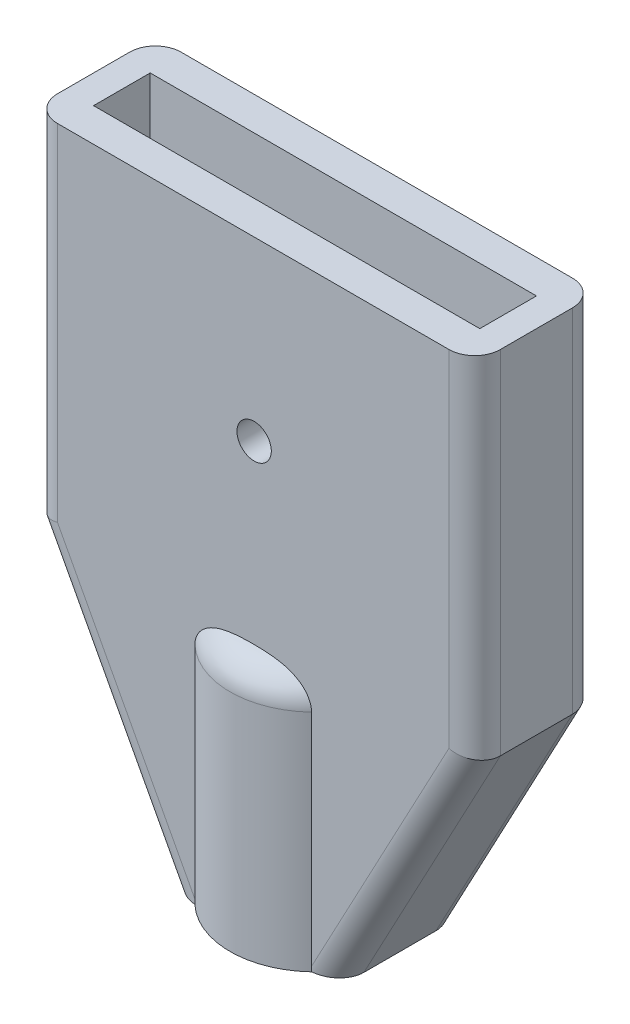
ISO-10303-21;
HEADER;
FILE_DESCRIPTION(('STEP AP214'),'2;1');
FILE_NAME('part.step','',(''),(''),'','','');
FILE_SCHEMA(('AUTOMOTIVE_DESIGN { 1 0 10303 214 1 1 1 1 }'));
ENDSEC;
DATA;
#1=APPLICATION_CONTEXT('core data for automotive mechanical design processes');
#2=APPLICATION_PROTOCOL_DEFINITION('international standard','automotive_design',2000,#1);
#3=PRODUCT_CONTEXT('',#1,'mechanical');
#4=PRODUCT('Part','Part','',(#3));
#5=PRODUCT_RELATED_PRODUCT_CATEGORY('part','',(#4));
#6=PRODUCT_DEFINITION_FORMATION('','',#4);
#7=PRODUCT_DEFINITION_CONTEXT('part definition',#1,'design');
#8=PRODUCT_DEFINITION('design','',#6,#7);
#9=PRODUCT_DEFINITION_SHAPE('','',#8);
#10=(LENGTH_UNIT() NAMED_UNIT(*) SI_UNIT(.MILLI.,.METRE.));
#11=(NAMED_UNIT(*) PLANE_ANGLE_UNIT() SI_UNIT($,.RADIAN.));
#12=(NAMED_UNIT(*) SI_UNIT($,.STERADIAN.) SOLID_ANGLE_UNIT());
#13=UNCERTAINTY_MEASURE_WITH_UNIT(LENGTH_MEASURE(1.E-05),#10,'distance_accuracy_value','');
#14=(GEOMETRIC_REPRESENTATION_CONTEXT(3) GLOBAL_UNCERTAINTY_ASSIGNED_CONTEXT((#13)) GLOBAL_UNIT_ASSIGNED_CONTEXT((#10,
#11,#12)) REPRESENTATION_CONTEXT('',''));
#15=CARTESIAN_POINT('',(0.,0.,0.));
#16=DIRECTION('',(0.,0.,1.));
#17=DIRECTION('',(1.,0.,0.));
#18=AXIS2_PLACEMENT_3D('',#15,#16,#17);
#19=CARTESIAN_POINT('',(12.9,-14.9,-3.6));
#20=DIRECTION('',(0.,1.,0.));
#21=DIRECTION('',(0.,0.,1.));
#22=AXIS2_PLACEMENT_3D('',#19,#20,#21);
#23=CYLINDRICAL_SURFACE('',#22,4.95);
#24=DIRECTION('',(0.,1.,0.));
#25=VECTOR('',#24,1.);
#26=CARTESIAN_POINT('',(16.2974254958718,-14.9,0.));
#27=LINE('',#26,#25);
#28=CARTESIAN_POINT('',(16.2974254958718,-1.8,0.));
#29=VERTEX_POINT('',#28);
#30=CARTESIAN_POINT('',(16.2974254958718,-14.623397080021,0.));
#31=VERTEX_POINT('',#30);
#32=EDGE_CURVE('E415',#29,#31,#27,.F.);
#33=ORIENTED_EDGE('',*,*,#32,.F.);
#34=CARTESIAN_POINT('',(12.9,-1.8,-3.6));
#35=DIRECTION('',(0.,-1.,0.));
#36=DIRECTION('',(0.,0.,-1.));
#37=AXIS2_PLACEMENT_3D('',#34,#35,#36);
#38=CIRCLE('',#37,4.95);
#39=CARTESIAN_POINT('',(9.50257450412816,-1.8,0.));
#40=VERTEX_POINT('',#39);
#41=EDGE_CURVE('E360',#29,#40,#38,.T.);
#42=ORIENTED_EDGE('',*,*,#41,.T.);
#43=DIRECTION('',(0.,1.,0.));
#44=VECTOR('',#43,1.);
#45=CARTESIAN_POINT('',(9.50257450412816,-14.9,0.));
#46=LINE('',#45,#44);
#47=CARTESIAN_POINT('',(9.50257450412816,-14.623397080021,0.));
#48=VERTEX_POINT('',#47);
#49=EDGE_CURVE('E418',#48,#40,#46,.T.);
#50=ORIENTED_EDGE('',*,*,#49,.F.);
#51=CARTESIAN_POINT('',(9.50257450412816,-14.623397080021,0.));
#52=CARTESIAN_POINT('',(9.50257425653096,-14.6464668807012,-2.90820112744665E-07));
#53=CARTESIAN_POINT('',(9.50244952979903,-14.6695370536505,-0.000117942516268078));
#54=CARTESIAN_POINT('',(9.50193414509048,-14.7156650824071,-0.000604401529351274));
#55=CARTESIAN_POINT('',(9.5015435635876,-14.7387229398487,-0.000973136621554745));
#56=CARTESIAN_POINT('',(9.50047951073166,-14.7848267694477,-0.00197818229298163));
#57=CARTESIAN_POINT('',(9.49980603668389,-14.8078727414899,-0.00261449542102848));
#58=CARTESIAN_POINT('',(9.49815638229056,-14.8539506769145,-0.00417448635983652));
#59=CARTESIAN_POINT('',(9.49718011492893,-14.8769826343606,-0.00509824677682251));
#60=CARTESIAN_POINT('',(9.4960427281121,-14.9,-0.00617545069858995));
#61=B_SPLINE_CURVE_WITH_KNOTS('',3,(#51,#52,#53,#54,#55,#56,#57,#58,#59,#60),.UNSPECIFIED.,.F.,
.F.,(4,2,2,2,4),(0.,0.0692093050111071,0.138398710209566,0.207588774488925,0.276798740910322),.UNSPECIFIED.);
#62=CARTESIAN_POINT('',(9.49604272811181,-14.9,-0.00617545069854649));
#63=VERTEX_POINT('',#62);
#64=EDGE_CURVE('E312',#48,#63,#61,.T.);
#65=ORIENTED_EDGE('',*,*,#64,.T.);
#66=CARTESIAN_POINT('',(12.9,-14.9,-3.6));
#67=DIRECTION('',(0.,-1.,0.));
#68=DIRECTION('',(0.,0.,-1.));
#69=AXIS2_PLACEMENT_3D('',#66,#67,#68);
#70=CIRCLE('',#69,4.95);
#71=CARTESIAN_POINT('',(16.3039572718882,-14.9,-0.00617545069854772));
#72=VERTEX_POINT('',#71);
#73=EDGE_CURVE('E433',#72,#63,#70,.T.);
#74=ORIENTED_EDGE('',*,*,#73,.F.);
#75=CARTESIAN_POINT('',(16.3039572718882,-14.9,-0.00617545069854772));
#76=CARTESIAN_POINT('',(16.3028198850712,-14.8769826343606,-0.00509824677680815));
#77=CARTESIAN_POINT('',(16.3018436177095,-14.8539506769145,-0.00417448635983346));
#78=CARTESIAN_POINT('',(16.3001939633161,-14.8078727414899,-0.00261449542103337));
#79=CARTESIAN_POINT('',(16.2995204892683,-14.7848267694477,-0.00197818229298319));
#80=CARTESIAN_POINT('',(16.2984564364124,-14.7387229398487,-0.000973136621553617));
#81=CARTESIAN_POINT('',(16.2980658549095,-14.7156650824071,-0.000604401529350757));
#82=CARTESIAN_POINT('',(16.297550470201,-14.6695370536505,-0.000117942516268759));
#83=CARTESIAN_POINT('',(16.297425743469,-14.6464668807012,-2.90820114016495E-07));
#84=CARTESIAN_POINT('',(16.2974254958718,-14.623397080021,0.));
#85=B_SPLINE_CURVE_WITH_KNOTS('',3,(#75,#76,#77,#78,#79,#80,#81,#82,#83,#84),.UNSPECIFIED.,.F.,
.F.,(4,2,2,2,4),(0.,0.0692099664214061,0.138400030700776,0.207589435899238,0.27679874091035),.UNSPECIFIED.);
#86=EDGE_CURVE('E347',#72,#31,#85,.T.);
#87=ORIENTED_EDGE('',*,*,#86,.T.);
#88=EDGE_LOOP('',(#33,#42,#50,#65,#74,#87));
#89=FACE_BOUND('',#88,.T.);
#90=ADVANCED_FACE('F35',(#89),#23,.T.);
#91=CARTESIAN_POINT('',(0.,20.5,0.));
#92=DIRECTION('',(1.,0.,0.));
#93=DIRECTION('',(0.,0.,-1.));
#94=AXIS2_PLACEMENT_3D('',#91,#92,#93);
#95=PLANE('',#94);
#96=DIRECTION('',(0.,0.,1.));
#97=VECTOR('',#96,1.);
#98=CARTESIAN_POINT('',(0.,20.5,0.));
#99=LINE('',#98,#97);
#100=CARTESIAN_POINT('',(0.,20.5,-5.7));
#101=VERTEX_POINT('',#100);
#102=CARTESIAN_POINT('',(0.,20.5,-1.5));
#103=VERTEX_POINT('',#102);
#104=EDGE_CURVE('E230',#101,#103,#99,.T.);
#105=ORIENTED_EDGE('',*,*,#104,.F.);
#106=DIRECTION('',(0.,-1.,0.));
#107=VECTOR('',#106,1.);
#108=CARTESIAN_POINT('',(0.,20.5,-5.7));
#109=LINE('',#108,#107);
#110=CARTESIAN_POINT('',(0.,0.,-5.7));
#111=VERTEX_POINT('',#110);
#112=EDGE_CURVE('E253',#101,#111,#109,.T.);
#113=ORIENTED_EDGE('',*,*,#112,.T.);
#114=DIRECTION('',(0.,0.,1.));
#115=VECTOR('',#114,1.);
#116=CARTESIAN_POINT('',(0.,0.,0.));
#117=LINE('',#116,#115);
#118=CARTESIAN_POINT('',(0.,0.,-1.5));
#119=VERTEX_POINT('',#118);
#120=EDGE_CURVE('E226',#111,#119,#117,.T.);
#121=ORIENTED_EDGE('',*,*,#120,.T.);
#122=DIRECTION('',(0.,-1.,0.));
#123=VECTOR('',#122,1.);
#124=CARTESIAN_POINT('',(0.,20.5,-1.5));
#125=LINE('',#124,#123);
#126=EDGE_CURVE('E243',#119,#103,#125,.F.);
#127=ORIENTED_EDGE('',*,*,#126,.T.);
#128=EDGE_LOOP('',(#105,#113,#121,#127));
#129=FACE_BOUND('',#128,.T.);
#130=ADVANCED_FACE('F382',(#129),#95,.F.);
#131=CARTESIAN_POINT('',(0.,20.5,0.));
#132=DIRECTION('',(0.,0.,-1.));
#133=DIRECTION('',(-1.,0.,0.));
#134=AXIS2_PLACEMENT_3D('',#131,#132,#133);
#135=PLANE('',#134);
#136=CARTESIAN_POINT('',(12.9539711529674,10.2,0.));
#137=DIRECTION('',(0.,0.,-1.));
#138=DIRECTION('',(-1.,0.,0.));
#139=AXIS2_PLACEMENT_3D('',#136,#137,#138);
#140=CIRCLE('',#139,1.);
#141=CARTESIAN_POINT('',(11.9539711529674,10.2,0.));
#142=VERTEX_POINT('',#141);
#143=EDGE_CURVE('E251',#142,#142,#140,.T.);
#144=ORIENTED_EDGE('',*,*,#143,.T.);
#145=EDGE_LOOP('',(#144));
#146=FACE_BOUND('',#145,.T.);
#147=DIRECTION('',(1.,0.,0.));
#148=VECTOR('',#147,1.);
#149=CARTESIAN_POINT('',(0.,20.5,0.));
#150=LINE('',#149,#148);
#151=CARTESIAN_POINT('',(1.5,20.5,0.));
#152=VERTEX_POINT('',#151);
#153=CARTESIAN_POINT('',(24.3,20.5,0.));
#154=VERTEX_POINT('',#153);
#155=EDGE_CURVE('E233',#152,#154,#150,.T.);
#156=ORIENTED_EDGE('',*,*,#155,.F.);
#157=DIRECTION('',(0.,-1.,0.));
#158=VECTOR('',#157,1.);
#159=CARTESIAN_POINT('',(1.5,20.5,0.));
#160=LINE('',#159,#158);
#161=CARTESIAN_POINT('',(1.5,0.375138783061967,0.));
#162=VERTEX_POINT('',#161);
#163=EDGE_CURVE('E295',#152,#162,#160,.T.);
#164=ORIENTED_EDGE('',*,*,#163,.T.);
#165=DIRECTION('',(0.470741894637564,-0.882270972339585,0.));
#166=VECTOR('',#165,1.);
#167=CARTESIAN_POINT('',(-7.19069267809929,16.6633552489336,0.));
#168=LINE('',#167,#166);
#169=EDGE_CURVE('E293',#162,#48,#168,.T.);
#170=ORIENTED_EDGE('',*,*,#169,.T.);
#171=ORIENTED_EDGE('',*,*,#49,.T.);
#172=CARTESIAN_POINT('',(9.50257450412816,-1.8,0.));
#173=CARTESIAN_POINT('',(9.50257010611367,-1.76179514013385,0.));
#174=CARTESIAN_POINT('',(9.50434819541992,-1.72361238073884,0.));
#175=CARTESIAN_POINT('',(9.51140889028118,-1.6475920372073,0.));
#176=CARTESIAN_POINT('',(9.5166896518964,-1.60975428206654,0.));
#177=CARTESIAN_POINT('',(9.53759071648282,-1.49772518921536,0.));
#178=CARTESIAN_POINT('',(9.55827196228777,-1.42442338777742,0.));
#179=CARTESIAN_POINT('',(9.61184839627756,-1.28266505372452,0.));
#180=CARTESIAN_POINT('',(9.64472374202501,-1.21420086355642,0.));
#181=CARTESIAN_POINT('',(9.72095334475818,-1.0832984787995,0.));
#182=CARTESIAN_POINT('',(9.76432478075895,-1.02087040042425,0.));
#183=CARTESIAN_POINT('',(9.87442071666975,-0.884632985754218,0.));
#184=CARTESIAN_POINT('',(9.94421490897233,-0.813308345207561,0.));
#185=CARTESIAN_POINT('',(10.094409092403,-0.682965354253833,0.));
#186=CARTESIAN_POINT('',(10.1748240602064,-0.623964691319854,0.));
#187=CARTESIAN_POINT('',(10.3819837502156,-0.492886258059277,0.));
#188=CARTESIAN_POINT('',(10.5129039790851,-0.427455799033697,0.));
#189=CARTESIAN_POINT('',(10.7830425913332,-0.317386334061299,0.));
#190=CARTESIAN_POINT('',(10.9222763506775,-0.272787289551552,0.));
#191=CARTESIAN_POINT('',(11.2122191259241,-0.197686797261574,0.));
#192=CARTESIAN_POINT('',(11.3631450159404,-0.168058983781912,0.));
#193=CARTESIAN_POINT('',(11.6670171375072,-0.121432535806466,0.));
#194=CARTESIAN_POINT('',(11.8199660712527,-0.104453003209829,0.));
#195=CARTESIAN_POINT('',(12.1273846640792,-0.0789945298229847,0.));
#196=CARTESIAN_POINT('',(12.2818580252363,-0.0705644659136082,0.));
#197=CARTESIAN_POINT('',(12.5908878964962,-0.0596471931441317,0.));
#198=CARTESIAN_POINT('',(12.7454442841249,-0.0571560593264221,0.));
#199=CARTESIAN_POINT('',(13.0496182719922,-0.0571588832481529,0.));
#200=CARTESIAN_POINT('',(13.1992359144651,-0.0594961293535861,0.));
#201=CARTESIAN_POINT('',(13.4983950866038,-0.0696878428206477,0.));
#202=CARTESIAN_POINT('',(13.647936517654,-0.0775455999131362,0.));
#203=CARTESIAN_POINT('',(13.9454455243416,-0.101105605120963,0.));
#204=CARTESIAN_POINT('',(14.09341695345,-0.116755348088627,0.));
#205=CARTESIAN_POINT('',(14.3876361049301,-0.159483098310369,0.));
#206=CARTESIAN_POINT('',(14.5338859149368,-0.186545385658494,0.));
#207=CARTESIAN_POINT('',(14.7862265854637,-0.247814153270298,0.));
#208=CARTESIAN_POINT('',(14.893151723429,-0.278502768152373,0.));
#209=CARTESIAN_POINT('',(15.1034171023221,-0.350990618098968,0.));
#210=CARTESIAN_POINT('',(15.2067529059753,-0.392803088343327,0.));
#211=CARTESIAN_POINT('',(15.4081145109884,-0.490039215992964,0.));
#212=CARTESIAN_POINT('',(15.5060833671018,-0.545583392401865,0.));
#213=CARTESIAN_POINT('',(15.6917893034592,-0.671794064543471,0.));
#214=CARTESIAN_POINT('',(15.7795453485059,-0.742431816907016,0.));
#215=CARTESIAN_POINT('',(15.9185955159091,-0.878649976784359,0.));
#216=CARTESIAN_POINT('',(15.9733979984651,-0.940637976223836,0.));
#217=CARTESIAN_POINT('',(16.072352141806,-1.07271751836982,0.));
#218=CARTESIAN_POINT('',(16.1165039137843,-1.14280897646495,0.));
#219=CARTESIAN_POINT('',(16.1919683762595,-1.29042253244039,0.));
#220=CARTESIAN_POINT('',(16.2231664736964,-1.36800376671347,0.));
#221=CARTESIAN_POINT('',(16.2699141314311,-1.52767134438289,0.));
#222=CARTESIAN_POINT('',(16.2855063767709,-1.60974474786499,0.));
#223=CARTESIAN_POINT('',(16.2942978419557,-1.71028607631279,0.));
#224=CARTESIAN_POINT('',(16.29547080565,-1.72822083101857,0.));
#225=CARTESIAN_POINT('',(16.2970331842484,-1.76410114546743,0.));
#226=CARTESIAN_POINT('',(16.2974236143154,-1.7820466609622,0.));
#227=CARTESIAN_POINT('',(16.2974254958721,-1.79999999999998,0.));
#228=B_SPLINE_CURVE_WITH_KNOTS('',3,(#172,#173,#174,#175,#176,#177,#178,#179,#180,#181,#182,
#183,#184,#185,#186,#187,#188,#189,#190,#191,#192,#193,#194,#195,#196,#197,#198,#199,#200,#201,
#202,#203,#204,#205,#206,#207,#208,#209,#210,#211,#212,#213,#214,#215,#216,#217,#218,#219,#220,
#221,#222,#223,#224,#225,#226,#227),.UNSPECIFIED.,.F.,.F.,(4,2,2,2,2,2,2,2,2,2,2,2,2,2,2,2,2,2,
2,2,2,2,2,2,2,2,2,4),(0.,0.114530717531855,0.229001189544636,0.456185131409599,
0.683001006155055,0.910190652807316,1.20792160371779,1.50607696822437,1.94266568577731,
2.380088517365,2.84072224232821,3.30205023069331,3.76600098812542,4.22964504174965,
4.67847750148723,5.1275776523467,5.5736917508964,6.0191933582275,6.35245074163372,
6.68610642234942,7.02280147763595,7.35886097474349,7.60615513904536,7.85344672148514,
8.10288158365135,8.35163231302484,8.40554243402884,8.45938257328075),.UNSPECIFIED.);
#229=EDGE_CURVE('E48',#40,#29,#228,.T.);
#230=ORIENTED_EDGE('',*,*,#229,.T.);
#231=ORIENTED_EDGE('',*,*,#32,.T.);
#232=DIRECTION('',(0.470741894637564,0.882270972339585,0.));
#233=VECTOR('',#232,1.);
#234=CARTESIAN_POINT('',(27.2734660488316,5.94804999407975,0.));
#235=LINE('',#234,#233);
#236=CARTESIAN_POINT('',(24.3,0.375138783061975,0.));
#237=VERTEX_POINT('',#236);
#238=EDGE_CURVE('E290',#31,#237,#235,.T.);
#239=ORIENTED_EDGE('',*,*,#238,.T.);
#240=DIRECTION('',(0.,-1.,0.));
#241=VECTOR('',#240,1.);
#242=CARTESIAN_POINT('',(24.3,20.5,0.));
#243=LINE('',#242,#241);
#244=EDGE_CURVE('E288',#237,#154,#243,.F.);
#245=ORIENTED_EDGE('',*,*,#244,.T.);
#246=EDGE_LOOP('',(#156,#164,#170,#171,#230,#231,#239,#245));
#247=FACE_BOUND('',#246,.T.);
#248=ADVANCED_FACE('F377',(#146,#247),#135,.F.);
#249=CARTESIAN_POINT('',(25.8,20.5,0.));
#250=DIRECTION('',(-1.,0.,0.));
#251=DIRECTION('',(0.,0.,1.));
#252=AXIS2_PLACEMENT_3D('',#249,#250,#251);
#253=PLANE('',#252);
#254=DIRECTION('',(0.,0.,-1.));
#255=VECTOR('',#254,1.);
#256=CARTESIAN_POINT('',(25.8,20.5,0.));
#257=LINE('',#256,#255);
#258=CARTESIAN_POINT('',(25.8,20.5,-1.5));
#259=VERTEX_POINT('',#258);
#260=CARTESIAN_POINT('',(25.8,20.5,-5.7));
#261=VERTEX_POINT('',#260);
#262=EDGE_CURVE('E237',#259,#261,#257,.T.);
#263=ORIENTED_EDGE('',*,*,#262,.F.);
#264=DIRECTION('',(0.,-1.,0.));
#265=VECTOR('',#264,1.);
#266=CARTESIAN_POINT('',(25.8,20.5,-1.5));
#267=LINE('',#266,#265);
#268=CARTESIAN_POINT('',(25.8,0.,-1.5));
#269=VERTEX_POINT('',#268);
#270=EDGE_CURVE('E303',#259,#269,#267,.T.);
#271=ORIENTED_EDGE('',*,*,#270,.T.);
#272=DIRECTION('',(0.,0.,-1.));
#273=VECTOR('',#272,1.);
#274=CARTESIAN_POINT('',(25.8,0.,0.));
#275=LINE('',#274,#273);
#276=CARTESIAN_POINT('',(25.8,0.,-5.7));
#277=VERTEX_POINT('',#276);
#278=EDGE_CURVE('E234',#269,#277,#275,.T.);
#279=ORIENTED_EDGE('',*,*,#278,.T.);
#280=DIRECTION('',(0.,-1.,0.));
#281=VECTOR('',#280,1.);
#282=CARTESIAN_POINT('',(25.8,20.5,-5.7));
#283=LINE('',#282,#281);
#284=EDGE_CURVE('E301',#277,#261,#283,.F.);
#285=ORIENTED_EDGE('',*,*,#284,.T.);
#286=EDGE_LOOP('',(#263,#271,#279,#285));
#287=FACE_BOUND('',#286,.T.);
#288=ADVANCED_FACE('F381',(#287),#253,.F.);
#289=CARTESIAN_POINT('',(0.,20.5,-7.2));
#290=DIRECTION('',(0.,0.,1.));
#291=DIRECTION('',(1.,0.,0.));
#292=AXIS2_PLACEMENT_3D('',#289,#290,#291);
#293=PLANE('',#292);
#294=CARTESIAN_POINT('',(12.9539711529674,10.2,-7.2));
#295=DIRECTION('',(0.,0.,1.));
#296=DIRECTION('',(1.,0.,0.));
#297=AXIS2_PLACEMENT_3D('',#294,#295,#296);
#298=CIRCLE('',#297,1.);
#299=CARTESIAN_POINT('',(13.9539711529674,10.2,-7.2));
#300=VERTEX_POINT('',#299);
#301=EDGE_CURVE('E214',#300,#300,#298,.T.);
#302=ORIENTED_EDGE('',*,*,#301,.T.);
#303=EDGE_LOOP('',(#302));
#304=FACE_BOUND('',#303,.T.);
#305=DIRECTION('',(0.470741894637564,-0.882270972339585,0.));
#306=VECTOR('',#305,1.);
#307=CARTESIAN_POINT('',(-7.19069267809929,16.6633552489336,-7.2));
#308=LINE('',#307,#306);
#309=CARTESIAN_POINT('',(9.50257450412816,-14.623397080021,-7.2));
#310=VERTEX_POINT('',#309);
#311=CARTESIAN_POINT('',(1.5,0.375138783061967,-7.2));
#312=VERTEX_POINT('',#311);
#313=EDGE_CURVE('E262',#310,#312,#308,.F.);
#314=ORIENTED_EDGE('',*,*,#313,.T.);
#315=DIRECTION('',(0.,-1.,0.));
#316=VECTOR('',#315,1.);
#317=CARTESIAN_POINT('',(1.5,20.5,-7.2));
#318=LINE('',#317,#316);
#319=CARTESIAN_POINT('',(1.5,20.5,-7.2));
#320=VERTEX_POINT('',#319);
#321=EDGE_CURVE('E264',#312,#320,#318,.F.);
#322=ORIENTED_EDGE('',*,*,#321,.T.);
#323=DIRECTION('',(-1.,0.,0.));
#324=VECTOR('',#323,1.);
#325=CARTESIAN_POINT('',(0.,20.5,-7.2));
#326=LINE('',#325,#324);
#327=CARTESIAN_POINT('',(24.3,20.5,-7.2));
#328=VERTEX_POINT('',#327);
#329=EDGE_CURVE('E240',#328,#320,#326,.T.);
#330=ORIENTED_EDGE('',*,*,#329,.F.);
#331=DIRECTION('',(0.,-1.,0.));
#332=VECTOR('',#331,1.);
#333=CARTESIAN_POINT('',(24.3,20.5,-7.2));
#334=LINE('',#333,#332);
#335=CARTESIAN_POINT('',(24.3,0.375138783061975,-7.2));
#336=VERTEX_POINT('',#335);
#337=EDGE_CURVE('E259',#328,#336,#334,.T.);
#338=ORIENTED_EDGE('',*,*,#337,.T.);
#339=DIRECTION('',(0.470741894637564,0.882270972339585,0.));
#340=VECTOR('',#339,1.);
#341=CARTESIAN_POINT('',(27.2734660488316,5.94804999407975,-7.2));
#342=LINE('',#341,#340);
#343=CARTESIAN_POINT('',(16.2974254958718,-14.623397080021,-7.2));
#344=VERTEX_POINT('',#343);
#345=EDGE_CURVE('E256',#336,#344,#342,.F.);
#346=ORIENTED_EDGE('',*,*,#345,.T.);
#347=DIRECTION('',(0.,1.,0.));
#348=VECTOR('',#347,1.);
#349=CARTESIAN_POINT('',(16.2974254958718,-14.9,-7.2));
#350=LINE('',#349,#348);
#351=CARTESIAN_POINT('',(16.2974254958718,-1.8,-7.2));
#352=VERTEX_POINT('',#351);
#353=EDGE_CURVE('E427',#352,#344,#350,.F.);
#354=ORIENTED_EDGE('',*,*,#353,.F.);
#355=CARTESIAN_POINT('',(16.2974254958718,-1.8,-7.2));
#356=CARTESIAN_POINT('',(16.2974298938863,-1.76179514013385,-7.2));
#357=CARTESIAN_POINT('',(16.2956518045801,-1.72361238073884,-7.2));
#358=CARTESIAN_POINT('',(16.2885911097188,-1.6475920372073,-7.2));
#359=CARTESIAN_POINT('',(16.2833103481036,-1.60975428206654,-7.2));
#360=CARTESIAN_POINT('',(16.2624092835172,-1.49772518921536,-7.2));
#361=CARTESIAN_POINT('',(16.2417280377122,-1.42442338777742,-7.2));
#362=CARTESIAN_POINT('',(16.1881516037224,-1.28266505372452,-7.2));
#363=CARTESIAN_POINT('',(16.155276257975,-1.21420086355642,-7.2));
#364=CARTESIAN_POINT('',(16.0790466552418,-1.0832984787995,-7.2));
#365=CARTESIAN_POINT('',(16.0356752192411,-1.02087040042425,-7.2));
#366=CARTESIAN_POINT('',(15.9255792833303,-0.884632985754219,-7.2));
#367=CARTESIAN_POINT('',(15.8557850910277,-0.813308345207562,-7.2));
#368=CARTESIAN_POINT('',(15.705590907597,-0.682965354253834,-7.2));
#369=CARTESIAN_POINT('',(15.6251759397936,-0.623964691319854,-7.2));
#370=CARTESIAN_POINT('',(15.4180162497844,-0.492886258059277,-7.2));
#371=CARTESIAN_POINT('',(15.2870960209149,-0.427455799033697,-7.2));
#372=CARTESIAN_POINT('',(15.0169574086668,-0.317386334061299,-7.2));
#373=CARTESIAN_POINT('',(14.8777236493225,-0.272787289551552,-7.2));
#374=CARTESIAN_POINT('',(14.5877808740759,-0.197686797261574,-7.2));
#375=CARTESIAN_POINT('',(14.4368549840596,-0.168058983781911,-7.2));
#376=CARTESIAN_POINT('',(14.1329828624927,-0.121432535806466,-7.2));
#377=CARTESIAN_POINT('',(13.9800339287473,-0.104453003209829,-7.2));
#378=CARTESIAN_POINT('',(13.6726153359208,-0.0789945298229845,-7.2));
#379=CARTESIAN_POINT('',(13.5181419747637,-0.0705644659136077,-7.2));
#380=CARTESIAN_POINT('',(13.2091121035038,-0.0596471931441311,-7.2));
#381=CARTESIAN_POINT('',(13.0545557158751,-0.0571560593264218,-7.2));
#382=CARTESIAN_POINT('',(12.7503817280078,-0.0571588832481531,-7.2));
#383=CARTESIAN_POINT('',(12.6007640855349,-0.0594961293535864,-7.2));
#384=CARTESIAN_POINT('',(12.3016049133962,-0.0696878428206481,-7.2));
#385=CARTESIAN_POINT('',(12.152063482346,-0.0775455999131365,-7.2));
#386=CARTESIAN_POINT('',(11.8545544756584,-0.101105605120964,-7.2));
#387=CARTESIAN_POINT('',(11.70658304655,-0.116755348088627,-7.2));
#388=CARTESIAN_POINT('',(11.4123638950699,-0.15948309831037,-7.2));
#389=CARTESIAN_POINT('',(11.2661140850632,-0.186545385658496,-7.2));
#390=CARTESIAN_POINT('',(11.0137734145363,-0.247814153270301,-7.2));
#391=CARTESIAN_POINT('',(10.906848276571,-0.278502768152376,-7.2));
#392=CARTESIAN_POINT('',(10.6965828976779,-0.35099061809897,-7.2));
#393=CARTESIAN_POINT('',(10.5932470940247,-0.392803088343329,-7.2));
#394=CARTESIAN_POINT('',(10.3918854890116,-0.490039215992966,-7.2));
#395=CARTESIAN_POINT('',(10.2939166328982,-0.545583392401868,-7.2));
#396=CARTESIAN_POINT('',(10.1082106965408,-0.671794064543475,-7.2));
#397=CARTESIAN_POINT('',(10.0204546514941,-0.74243181690702,-7.2));
#398=CARTESIAN_POINT('',(9.88140448409085,-0.878649976784364,-7.2));
#399=CARTESIAN_POINT('',(9.82660200153492,-0.940637976223839,-7.2));
#400=CARTESIAN_POINT('',(9.72764785819404,-1.07271751836983,-7.2));
#401=CARTESIAN_POINT('',(9.6834960862157,-1.14280897646495,-7.2));
#402=CARTESIAN_POINT('',(9.60803162374049,-1.2904225324404,-7.2));
#403=CARTESIAN_POINT('',(9.57683352630361,-1.36800376671347,-7.2));
#404=CARTESIAN_POINT('',(9.53008586856886,-1.52767134438289,-7.2));
#405=CARTESIAN_POINT('',(9.51449362322909,-1.60974474786499,-7.2));
#406=CARTESIAN_POINT('',(9.50570215804426,-1.71028607631279,-7.2));
#407=CARTESIAN_POINT('',(9.50452919434998,-1.72822083101857,-7.2));
#408=CARTESIAN_POINT('',(9.50296681575163,-1.76410114546743,-7.2));
#409=CARTESIAN_POINT('',(9.50257638568455,-1.7820466609622,-7.2));
#410=CARTESIAN_POINT('',(9.50257450412791,-1.79999999999998,-7.2));
#411=B_SPLINE_CURVE_WITH_KNOTS('',3,(#355,#356,#357,#358,#359,#360,#361,#362,#363,#364,#365,
#366,#367,#368,#369,#370,#371,#372,#373,#374,#375,#376,#377,#378,#379,#380,#381,#382,#383,#384,
#385,#386,#387,#388,#389,#390,#391,#392,#393,#394,#395,#396,#397,#398,#399,#400,#401,#402,#403,
#404,#405,#406,#407,#408,#409,#410),.UNSPECIFIED.,.F.,.F.,(4,2,2,2,2,2,2,2,2,2,2,2,2,2,2,2,2,2,
2,2,2,2,2,2,2,2,2,4),(0.,0.114530717531855,0.229001189544635,0.456185131409599,
0.683001006155055,0.910190652807316,1.20792160371779,1.50607696822437,1.9426656857773,
2.380088517365,2.84072224232821,3.30205023069331,3.76600098812543,4.22964504174966,
4.67847750148724,5.12757765234671,5.5736917508964,6.01919335822751,6.35245074163372,
6.68610642234942,7.02280147763595,7.3588609747435,7.60615513904536,7.85344672148514,
8.10288158365135,8.35163231302485,8.40554243402884,8.45938257328075),.UNSPECIFIED.);
#412=CARTESIAN_POINT('',(9.50257450412816,-1.8,-7.2));
#413=VERTEX_POINT('',#412);
#414=EDGE_CURVE('E11',#352,#413,#411,.T.);
#415=ORIENTED_EDGE('',*,*,#414,.T.);
#416=DIRECTION('',(0.,1.,0.));
#417=VECTOR('',#416,1.);
#418=CARTESIAN_POINT('',(9.50257450412816,-14.9,-7.2));
#419=LINE('',#418,#417);
#420=EDGE_CURVE('E429',#310,#413,#419,.T.);
#421=ORIENTED_EDGE('',*,*,#420,.F.);
#422=EDGE_LOOP('',(#314,#322,#330,#338,#346,#354,#415,#421));
#423=FACE_BOUND('',#422,.T.);
#424=ADVANCED_FACE('F441',(#304,#423),#293,.F.);
#425=CARTESIAN_POINT('',(0.,20.5,0.));
#426=DIRECTION('',(0.,-1.,0.));
#427=DIRECTION('',(0.,0.,-1.));
#428=AXIS2_PLACEMENT_3D('',#425,#426,#427);
#429=PLANE('',#428);
#430=DIRECTION('',(1.,0.,0.));
#431=VECTOR('',#430,1.);
#432=CARTESIAN_POINT('',(1.65,20.5,-1.95));
#433=LINE('',#432,#431);
#434=CARTESIAN_POINT('',(1.65,20.5,-1.95));
#435=VERTEX_POINT('',#434);
#436=CARTESIAN_POINT('',(24.15,20.5,-1.95));
#437=VERTEX_POINT('',#436);
#438=EDGE_CURVE('E220',#435,#437,#433,.T.);
#439=ORIENTED_EDGE('',*,*,#438,.F.);
#440=DIRECTION('',(0.,0.,1.));
#441=VECTOR('',#440,1.);
#442=CARTESIAN_POINT('',(1.65,20.5,-1.95));
#443=LINE('',#442,#441);
#444=CARTESIAN_POINT('',(1.65,20.5,-5.25));
#445=VERTEX_POINT('',#444);
#446=EDGE_CURVE('E191',#445,#435,#443,.T.);
#447=ORIENTED_EDGE('',*,*,#446,.F.);
#448=DIRECTION('',(-1.,0.,0.));
#449=VECTOR('',#448,1.);
#450=CARTESIAN_POINT('',(1.65,20.5,-5.25));
#451=LINE('',#450,#449);
#452=CARTESIAN_POINT('',(24.15,20.5,-5.25));
#453=VERTEX_POINT('',#452);
#454=EDGE_CURVE('E208',#453,#445,#451,.T.);
#455=ORIENTED_EDGE('',*,*,#454,.F.);
#456=DIRECTION('',(0.,0.,-1.));
#457=VECTOR('',#456,1.);
#458=CARTESIAN_POINT('',(24.15,20.5,-1.95));
#459=LINE('',#458,#457);
#460=EDGE_CURVE('E211',#437,#453,#459,.T.);
#461=ORIENTED_EDGE('',*,*,#460,.F.);
#462=EDGE_LOOP('',(#439,#447,#455,#461));
#463=FACE_BOUND('',#462,.T.);
#464=ORIENTED_EDGE('',*,*,#329,.T.);
#465=CARTESIAN_POINT('',(1.5,20.5,-5.7));
#466=DIRECTION('',(0.,-1.,0.));
#467=DIRECTION('',(0.,0.,-1.));
#468=AXIS2_PLACEMENT_3D('',#465,#466,#467);
#469=CIRCLE('',#468,1.5);
#470=EDGE_CURVE('E272',#320,#101,#469,.F.);
#471=ORIENTED_EDGE('',*,*,#470,.T.);
#472=ORIENTED_EDGE('',*,*,#104,.T.);
#473=CARTESIAN_POINT('',(1.5,20.5,-1.5));
#474=DIRECTION('',(0.,-1.,0.));
#475=DIRECTION('',(0.,0.,-1.));
#476=AXIS2_PLACEMENT_3D('',#473,#474,#475);
#477=CIRCLE('',#476,1.5);
#478=EDGE_CURVE('E270',#103,#152,#477,.F.);
#479=ORIENTED_EDGE('',*,*,#478,.T.);
#480=ORIENTED_EDGE('',*,*,#155,.T.);
#481=CARTESIAN_POINT('',(24.3,20.5,-1.5));
#482=DIRECTION('',(0.,-1.,0.));
#483=DIRECTION('',(0.,0.,-1.));
#484=AXIS2_PLACEMENT_3D('',#481,#482,#483);
#485=CIRCLE('',#484,1.5);
#486=EDGE_CURVE('E268',#154,#259,#485,.F.);
#487=ORIENTED_EDGE('',*,*,#486,.T.);
#488=ORIENTED_EDGE('',*,*,#262,.T.);
#489=CARTESIAN_POINT('',(24.3,20.5,-5.7));
#490=DIRECTION('',(0.,-1.,0.));
#491=DIRECTION('',(0.,0.,-1.));
#492=AXIS2_PLACEMENT_3D('',#489,#490,#491);
#493=CIRCLE('',#492,1.5);
#494=EDGE_CURVE('E266',#261,#328,#493,.F.);
#495=ORIENTED_EDGE('',*,*,#494,.T.);
#496=EDGE_LOOP('',(#464,#471,#472,#479,#480,#487,#488,#495));
#497=FACE_BOUND('',#496,.T.);
#498=ADVANCED_FACE('F468',(#463,#497),#429,.F.);
#499=CARTESIAN_POINT('',(1.65,2.5,-1.95));
#500=DIRECTION('',(-1.,0.,0.));
#501=DIRECTION('',(0.,0.,1.));
#502=AXIS2_PLACEMENT_3D('',#499,#500,#501);
#503=PLANE('',#502);
#504=ORIENTED_EDGE('',*,*,#446,.T.);
#505=DIRECTION('',(0.,1.,0.));
#506=VECTOR('',#505,1.);
#507=CARTESIAN_POINT('',(1.65,2.5,-1.95));
#508=LINE('',#507,#506);
#509=CARTESIAN_POINT('',(1.65,2.5,-1.95));
#510=VERTEX_POINT('',#509);
#511=EDGE_CURVE('E184',#510,#435,#508,.T.);
#512=ORIENTED_EDGE('',*,*,#511,.F.);
#513=DIRECTION('',(0.,0.,1.));
#514=VECTOR('',#513,1.);
#515=CARTESIAN_POINT('',(1.65,2.5,-1.95));
#516=LINE('',#515,#514);
#517=CARTESIAN_POINT('',(1.65,2.5,-5.25));
#518=VERTEX_POINT('',#517);
#519=EDGE_CURVE('E188',#518,#510,#516,.T.);
#520=ORIENTED_EDGE('',*,*,#519,.F.);
#521=DIRECTION('',(0.,1.,0.));
#522=VECTOR('',#521,1.);
#523=CARTESIAN_POINT('',(1.65,2.5,-5.25));
#524=LINE('',#523,#522);
#525=EDGE_CURVE('E224',#518,#445,#524,.T.);
#526=ORIENTED_EDGE('',*,*,#525,.T.);
#527=EDGE_LOOP('',(#504,#512,#520,#526));
#528=FACE_BOUND('',#527,.T.);
#529=ADVANCED_FACE('F186',(#528),#503,.F.);
#530=CARTESIAN_POINT('',(1.65,2.5,-5.25));
#531=DIRECTION('',(0.,0.,-1.));
#532=DIRECTION('',(-1.,0.,0.));
#533=AXIS2_PLACEMENT_3D('',#530,#531,#532);
#534=PLANE('',#533);
#535=CARTESIAN_POINT('',(12.9539711529674,10.2,-5.25));
#536=DIRECTION('',(0.,0.,-1.));
#537=DIRECTION('',(-1.,0.,0.));
#538=AXIS2_PLACEMENT_3D('',#535,#536,#537);
#539=CIRCLE('',#538,1.);
#540=CARTESIAN_POINT('',(11.9539711529674,10.2,-5.25));
#541=VERTEX_POINT('',#540);
#542=EDGE_CURVE('E250',#541,#541,#539,.T.);
#543=ORIENTED_EDGE('',*,*,#542,.T.);
#544=EDGE_LOOP('',(#543));
#545=FACE_BOUND('',#544,.T.);
#546=ORIENTED_EDGE('',*,*,#454,.T.);
#547=ORIENTED_EDGE('',*,*,#525,.F.);
#548=DIRECTION('',(-1.,0.,0.));
#549=VECTOR('',#548,1.);
#550=CARTESIAN_POINT('',(1.65,2.5,-5.25));
#551=LINE('',#550,#549);
#552=CARTESIAN_POINT('',(24.15,2.5,-5.25));
#553=VERTEX_POINT('',#552);
#554=EDGE_CURVE('E196',#553,#518,#551,.T.);
#555=ORIENTED_EDGE('',*,*,#554,.F.);
#556=DIRECTION('',(0.,1.,0.));
#557=VECTOR('',#556,1.);
#558=CARTESIAN_POINT('',(24.15,2.5,-5.25));
#559=LINE('',#558,#557);
#560=EDGE_CURVE('E227',#553,#453,#559,.T.);
#561=ORIENTED_EDGE('',*,*,#560,.T.);
#562=EDGE_LOOP('',(#546,#547,#555,#561));
#563=FACE_BOUND('',#562,.T.);
#564=ADVANCED_FACE('F456',(#545,#563),#534,.F.);
#565=CARTESIAN_POINT('',(24.15,2.5,-1.95));
#566=DIRECTION('',(1.,0.,0.));
#567=DIRECTION('',(0.,0.,-1.));
#568=AXIS2_PLACEMENT_3D('',#565,#566,#567);
#569=PLANE('',#568);
#570=ORIENTED_EDGE('',*,*,#460,.T.);
#571=ORIENTED_EDGE('',*,*,#560,.F.);
#572=DIRECTION('',(0.,0.,-1.));
#573=VECTOR('',#572,1.);
#574=CARTESIAN_POINT('',(24.15,2.5,-1.95));
#575=LINE('',#574,#573);
#576=CARTESIAN_POINT('',(24.15,2.5,-1.95));
#577=VERTEX_POINT('',#576);
#578=EDGE_CURVE('E204',#577,#553,#575,.T.);
#579=ORIENTED_EDGE('',*,*,#578,.F.);
#580=DIRECTION('',(0.,1.,0.));
#581=VECTOR('',#580,1.);
#582=CARTESIAN_POINT('',(24.15,2.5,-1.95));
#583=LINE('',#582,#581);
#584=EDGE_CURVE('E195',#577,#437,#583,.T.);
#585=ORIENTED_EDGE('',*,*,#584,.T.);
#586=EDGE_LOOP('',(#570,#571,#579,#585));
#587=FACE_BOUND('',#586,.T.);
#588=ADVANCED_FACE('F459',(#587),#569,.F.);
#589=CARTESIAN_POINT('',(1.65,2.5,-1.95));
#590=DIRECTION('',(0.,0.,1.));
#591=DIRECTION('',(1.,0.,0.));
#592=AXIS2_PLACEMENT_3D('',#589,#590,#591);
#593=PLANE('',#592);
#594=CARTESIAN_POINT('',(12.9539711529674,10.2,-1.95));
#595=DIRECTION('',(0.,0.,1.));
#596=DIRECTION('',(1.,0.,0.));
#597=AXIS2_PLACEMENT_3D('',#594,#595,#596);
#598=CIRCLE('',#597,1.);
#599=CARTESIAN_POINT('',(13.9539711529674,10.2,-1.95));
#600=VERTEX_POINT('',#599);
#601=EDGE_CURVE('E247',#600,#600,#598,.T.);
#602=ORIENTED_EDGE('',*,*,#601,.T.);
#603=EDGE_LOOP('',(#602));
#604=FACE_BOUND('',#603,.T.);
#605=ORIENTED_EDGE('',*,*,#438,.T.);
#606=ORIENTED_EDGE('',*,*,#584,.F.);
#607=DIRECTION('',(1.,0.,0.));
#608=VECTOR('',#607,1.);
#609=CARTESIAN_POINT('',(1.65,2.5,-1.95));
#610=LINE('',#609,#608);
#611=EDGE_CURVE('E199',#510,#577,#610,.T.);
#612=ORIENTED_EDGE('',*,*,#611,.F.);
#613=ORIENTED_EDGE('',*,*,#511,.T.);
#614=EDGE_LOOP('',(#605,#606,#612,#613));
#615=FACE_BOUND('',#614,.T.);
#616=ADVANCED_FACE('F200',(#604,#615),#593,.F.);
#617=CARTESIAN_POINT('',(0.,2.5,0.));
#618=DIRECTION('',(0.,-1.,0.));
#619=DIRECTION('',(0.,0.,-1.));
#620=AXIS2_PLACEMENT_3D('',#617,#618,#619);
#621=PLANE('',#620);
#622=ORIENTED_EDGE('',*,*,#519,.T.);
#623=ORIENTED_EDGE('',*,*,#611,.T.);
#624=ORIENTED_EDGE('',*,*,#578,.T.);
#625=ORIENTED_EDGE('',*,*,#554,.T.);
#626=EDGE_LOOP('',(#622,#623,#624,#625));
#627=FACE_BOUND('',#626,.T.);
#628=ADVANCED_FACE('F206',(#627),#621,.F.);
#629=CARTESIAN_POINT('',(12.9539711529674,10.2,0.));
#630=DIRECTION('',(0.,0.,-1.));
#631=DIRECTION('',(-1.,0.,0.));
#632=AXIS2_PLACEMENT_3D('',#629,#630,#631);
#633=CYLINDRICAL_SURFACE('',#632,1.);
#634=ORIENTED_EDGE('',*,*,#143,.F.);
#635=EDGE_LOOP('',(#634));
#636=FACE_BOUND('',#635,.T.);
#637=ORIENTED_EDGE('',*,*,#601,.F.);
#638=EDGE_LOOP('',(#637));
#639=FACE_BOUND('',#638,.T.);
#640=ADVANCED_FACE('F445',(#636,#639),#633,.F.);
#641=ORIENTED_EDGE('',*,*,#542,.F.);
#642=EDGE_LOOP('',(#641));
#643=FACE_BOUND('',#642,.T.);
#644=ORIENTED_EDGE('',*,*,#301,.F.);
#645=EDGE_LOOP('',(#644));
#646=FACE_BOUND('',#645,.T.);
#647=ADVANCED_FACE('F443',(#643,#646),#633,.F.);
#648=ORIENTED_EDGE('',*,*,#420,.T.);
#649=CARTESIAN_POINT('',(12.9,-1.8,-3.6));
#650=DIRECTION('',(0.,-1.,0.));
#651=DIRECTION('',(0.,0.,-1.));
#652=AXIS2_PLACEMENT_3D('',#649,#650,#651);
#653=CIRCLE('',#652,4.95);
#654=EDGE_CURVE('E375',#413,#352,#653,.T.);
#655=ORIENTED_EDGE('',*,*,#654,.T.);
#656=ORIENTED_EDGE('',*,*,#353,.T.);
#657=CARTESIAN_POINT('',(16.2974254958718,-14.623397080021,-7.2));
#658=CARTESIAN_POINT('',(16.297425743469,-14.6464668807012,-7.19999970917989));
#659=CARTESIAN_POINT('',(16.297550470201,-14.6695370536505,-7.19988205748373));
#660=CARTESIAN_POINT('',(16.2980658549095,-14.7156650824071,-7.19939559847065));
#661=CARTESIAN_POINT('',(16.2984564364124,-14.7387229398487,-7.19902686337845));
#662=CARTESIAN_POINT('',(16.2995204892683,-14.7848267694477,-7.19802181770702));
#663=CARTESIAN_POINT('',(16.3001939633161,-14.8078727414899,-7.19738550457897));
#664=CARTESIAN_POINT('',(16.3018436177094,-14.8539506769145,-7.19582551364016));
#665=CARTESIAN_POINT('',(16.3028198850711,-14.8769826343606,-7.19490175322318));
#666=CARTESIAN_POINT('',(16.3039572718879,-14.9,-7.19382454930141));
#667=B_SPLINE_CURVE_WITH_KNOTS('',3,(#657,#658,#659,#660,#661,#662,#663,#664,#665,#666),
.UNSPECIFIED.,.F.,.F.,(4,2,2,2,4),(0.,0.0692093050111088,0.138398710209569,0.207588774488932,
0.276798740910333),.UNSPECIFIED.);
#668=CARTESIAN_POINT('',(16.3039572718882,-14.9,-7.19382454930145));
#669=VERTEX_POINT('',#668);
#670=EDGE_CURVE('E353',#344,#669,#667,.T.);
#671=ORIENTED_EDGE('',*,*,#670,.T.);
#672=CARTESIAN_POINT('',(9.49604272811181,-14.9,-7.19382454930145));
#673=VERTEX_POINT('',#672);
#674=EDGE_CURVE('E431',#673,#669,#70,.T.);
#675=ORIENTED_EDGE('',*,*,#674,.F.);
#676=CARTESIAN_POINT('',(9.49604272811181,-14.9,-7.19382454930145));
#677=CARTESIAN_POINT('',(9.49718011492883,-14.8769826343606,-7.19490175322319));
#678=CARTESIAN_POINT('',(9.49815638229054,-14.8539506769145,-7.19582551364017));
#679=CARTESIAN_POINT('',(9.49980603668392,-14.8078727414899,-7.19738550457897));
#680=CARTESIAN_POINT('',(9.50047951073167,-14.7848267694477,-7.19802181770702));
#681=CARTESIAN_POINT('',(9.5015435635876,-14.7387229398487,-7.19902686337845));
#682=CARTESIAN_POINT('',(9.50193414509047,-14.7156650824071,-7.19939559847065));
#683=CARTESIAN_POINT('',(9.50244952979904,-14.6695370536505,-7.19988205748373));
#684=CARTESIAN_POINT('',(9.50257425653097,-14.6464668807012,-7.19999970917989));
#685=CARTESIAN_POINT('',(9.50257450412816,-14.623397080021,-7.2));
#686=B_SPLINE_CURVE_WITH_KNOTS('',3,(#676,#677,#678,#679,#680,#681,#682,#683,#684,#685),
.UNSPECIFIED.,.F.,.F.,(4,2,2,2,4),(0.,0.0692099664214043,0.138400030700769,0.207589435899228,
0.276798740910336),.UNSPECIFIED.);
#687=EDGE_CURVE('E305',#673,#310,#686,.T.);
#688=ORIENTED_EDGE('',*,*,#687,.T.);
#689=EDGE_LOOP('',(#648,#655,#656,#671,#675,#688));
#690=FACE_BOUND('',#689,.T.);
#691=ADVANCED_FACE('F318',(#690),#23,.T.);
#692=CARTESIAN_POINT('',(12.9,-14.9,-3.6));
#693=DIRECTION('',(0.,-1.,0.));
#694=DIRECTION('',(0.,0.,-1.));
#695=AXIS2_PLACEMENT_3D('',#692,#693,#694);
#696=PLANE('',#695);
#697=CARTESIAN_POINT('',(12.9,-14.9,-3.6));
#698=DIRECTION('',(0.,-1.,0.));
#699=DIRECTION('',(0.,0.,-1.));
#700=AXIS2_PLACEMENT_3D('',#697,#698,#699);
#701=CIRCLE('',#700,2.95);
#702=CARTESIAN_POINT('',(12.9,-14.9,-6.55));
#703=VERTEX_POINT('',#702);
#704=EDGE_CURVE('E402',#703,#703,#701,.T.);
#705=ORIENTED_EDGE('',*,*,#704,.F.);
#706=EDGE_LOOP('',(#705));
#707=FACE_BOUND('',#706,.T.);
#708=CARTESIAN_POINT('',(9.65015794129816,-14.9,-5.7));
#709=DIRECTION('',(0.,-1.,0.));
#710=DIRECTION('',(1.,0.,0.));
#711=AXIS2_PLACEMENT_3D('',#708,#709,#710);
#712=ELLIPSE('',#711,1.70015794129817,1.5);
#713=CARTESIAN_POINT('',(7.95,-14.9,-5.7));
#714=VERTEX_POINT('',#713);
#715=EDGE_CURVE('E285',#714,#673,#712,.T.);
#716=ORIENTED_EDGE('',*,*,#715,.T.);
#717=ORIENTED_EDGE('',*,*,#674,.T.);
#718=CARTESIAN_POINT('',(16.1498420587018,-14.9,-5.7));
#719=DIRECTION('',(0.,-1.,0.));
#720=DIRECTION('',(1.,0.,0.));
#721=AXIS2_PLACEMENT_3D('',#718,#719,#720);
#722=ELLIPSE('',#721,1.70015794129817,1.5);
#723=CARTESIAN_POINT('',(17.85,-14.9,-5.7));
#724=VERTEX_POINT('',#723);
#725=EDGE_CURVE('E278',#669,#724,#722,.T.);
#726=ORIENTED_EDGE('',*,*,#725,.T.);
#727=DIRECTION('',(0.,0.,-1.));
#728=VECTOR('',#727,1.);
#729=CARTESIAN_POINT('',(17.85,-14.9,0.));
#730=LINE('',#729,#728);
#731=CARTESIAN_POINT('',(17.85,-14.9,-1.5));
#732=VERTEX_POINT('',#731);
#733=EDGE_CURVE('E416',#732,#724,#730,.T.);
#734=ORIENTED_EDGE('',*,*,#733,.F.);
#735=CARTESIAN_POINT('',(16.1498420587018,-14.9,-1.5));
#736=DIRECTION('',(0.,-1.,0.));
#737=DIRECTION('',(1.,0.,0.));
#738=AXIS2_PLACEMENT_3D('',#735,#736,#737);
#739=ELLIPSE('',#738,1.70015794129817,1.5);
#740=EDGE_CURVE('E280',#732,#72,#739,.T.);
#741=ORIENTED_EDGE('',*,*,#740,.T.);
#742=ORIENTED_EDGE('',*,*,#73,.T.);
#743=CARTESIAN_POINT('',(9.65015794129816,-14.9,-1.5));
#744=DIRECTION('',(0.,-1.,0.));
#745=DIRECTION('',(1.,0.,0.));
#746=AXIS2_PLACEMENT_3D('',#743,#744,#745);
#747=ELLIPSE('',#746,1.70015794129817,1.5);
#748=CARTESIAN_POINT('',(7.95,-14.9,-1.5));
#749=VERTEX_POINT('',#748);
#750=EDGE_CURVE('E283',#63,#749,#747,.T.);
#751=ORIENTED_EDGE('',*,*,#750,.T.);
#752=DIRECTION('',(0.,0.,-1.));
#753=VECTOR('',#752,1.);
#754=CARTESIAN_POINT('',(7.95,-14.9,0.));
#755=LINE('',#754,#753);
#756=EDGE_CURVE('E410',#749,#714,#755,.T.);
#757=ORIENTED_EDGE('',*,*,#756,.T.);
#758=EDGE_LOOP('',(#716,#717,#726,#734,#741,#742,#751,#757));
#759=FACE_BOUND('',#758,.T.);
#760=ADVANCED_FACE('F413',(#707,#759),#696,.T.);
#761=CARTESIAN_POINT('',(20.0827733707323,-10.7153052548538,0.));
#762=DIRECTION('',(-0.882270972339585,0.470741894637564,0.));
#763=DIRECTION('',(-0.470741894637564,-0.882270972339585,0.));
#764=AXIS2_PLACEMENT_3D('',#761,#762,#763);
#765=PLANE('',#764);
#766=ORIENTED_EDGE('',*,*,#278,.F.);
#767=DIRECTION('',(0.470741894637564,0.882270972339585,0.));
#768=VECTOR('',#767,1.);
#769=CARTESIAN_POINT('',(20.0827733707323,-10.7153052548538,-1.5));
#770=LINE('',#769,#768);
#771=EDGE_CURVE('E299',#269,#732,#770,.F.);
#772=ORIENTED_EDGE('',*,*,#771,.T.);
#773=ORIENTED_EDGE('',*,*,#733,.T.);
#774=DIRECTION('',(0.470741894637564,0.882270972339585,0.));
#775=VECTOR('',#774,1.);
#776=CARTESIAN_POINT('',(20.0827733707323,-10.7153052548538,-5.7));
#777=LINE('',#776,#775);
#778=EDGE_CURVE('E75',#724,#277,#777,.T.);
#779=ORIENTED_EDGE('',*,*,#778,.T.);
#780=EDGE_LOOP('',(#766,#772,#773,#779));
#781=FACE_BOUND('',#780,.T.);
#782=ADVANCED_FACE('F503',(#781),#765,.F.);
#783=CARTESIAN_POINT('',(0.,0.,0.));
#784=DIRECTION('',(0.882270972339585,0.470741894637564,0.));
#785=DIRECTION('',(-0.470741894637564,0.882270972339585,0.));
#786=AXIS2_PLACEMENT_3D('',#783,#784,#785);
#787=PLANE('',#786);
#788=ORIENTED_EDGE('',*,*,#120,.F.);
#789=DIRECTION('',(0.470741894637564,-0.882270972339585,0.));
#790=VECTOR('',#789,1.);
#791=CARTESIAN_POINT('',(0.,0.,-5.7));
#792=LINE('',#791,#790);
#793=EDGE_CURVE('E276',#111,#714,#792,.T.);
#794=ORIENTED_EDGE('',*,*,#793,.T.);
#795=ORIENTED_EDGE('',*,*,#756,.F.);
#796=DIRECTION('',(0.470741894637564,-0.882270972339585,0.));
#797=VECTOR('',#796,1.);
#798=CARTESIAN_POINT('',(0.,0.,-1.5));
#799=LINE('',#798,#797);
#800=EDGE_CURVE('E274',#749,#119,#799,.F.);
#801=ORIENTED_EDGE('',*,*,#800,.T.);
#802=EDGE_LOOP('',(#788,#794,#795,#801));
#803=FACE_BOUND('',#802,.T.);
#804=ADVANCED_FACE('F409',(#803),#787,.F.);
#805=CARTESIAN_POINT('',(12.9,-1.4,-3.6));
#806=DIRECTION('',(0.,-1.,0.));
#807=DIRECTION('',(0.,0.,-1.));
#808=AXIS2_PLACEMENT_3D('',#805,#806,#807);
#809=CYLINDRICAL_SURFACE('',#808,2.95);
#810=CARTESIAN_POINT('',(12.9,-1.4,-3.6));
#811=DIRECTION('',(0.,-1.,0.));
#812=DIRECTION('',(0.,0.,-1.));
#813=AXIS2_PLACEMENT_3D('',#810,#811,#812);
#814=CIRCLE('',#813,2.95);
#815=CARTESIAN_POINT('',(12.9,-1.4,-6.55));
#816=VERTEX_POINT('',#815);
#817=EDGE_CURVE('E420',#816,#816,#814,.T.);
#818=ORIENTED_EDGE('',*,*,#817,.F.);
#819=EDGE_LOOP('',(#818));
#820=FACE_BOUND('',#819,.T.);
#821=ORIENTED_EDGE('',*,*,#704,.T.);
#822=EDGE_LOOP('',(#821));
#823=FACE_BOUND('',#822,.T.);
#824=ADVANCED_FACE('F572',(#820,#823),#809,.F.);
#825=CARTESIAN_POINT('',(12.9,-1.4,-3.6));
#826=DIRECTION('',(0.,-1.,0.));
#827=DIRECTION('',(0.,0.,-1.));
#828=AXIS2_PLACEMENT_3D('',#825,#826,#827);
#829=PLANE('',#828);
#830=ORIENTED_EDGE('',*,*,#817,.T.);
#831=EDGE_LOOP('',(#830));
#832=FACE_BOUND('',#831,.T.);
#833=ADVANCED_FACE('F328',(#832),#829,.T.);
#834=CARTESIAN_POINT('',(1.32340645850938,0.706112841956346,-5.7));
#835=DIRECTION('',(0.470741894637564,-0.882270972339585,0.));
#836=DIRECTION('',(0.882270972339585,0.470741894637564,0.));
#837=AXIS2_PLACEMENT_3D('',#834,#835,#836);
#838=CYLINDRICAL_SURFACE('',#837,1.5);
#839=ORIENTED_EDGE('',*,*,#715,.F.);
#840=ORIENTED_EDGE('',*,*,#793,.F.);
#841=CARTESIAN_POINT('',(1.5,0.375138783061963,-5.7));
#842=DIRECTION('',(0.242620101867524,-0.970121377029592,0.));
#843=DIRECTION('',(0.970121377029592,0.242620101867523,0.));
#844=AXIS2_PLACEMENT_3D('',#841,#842,#843);
#845=ELLIPSE('',#844,1.54619827530534,1.5);
#846=EDGE_CURVE('E361',#312,#111,#845,.F.);
#847=ORIENTED_EDGE('',*,*,#846,.F.);
#848=ORIENTED_EDGE('',*,*,#313,.F.);
#849=ORIENTED_EDGE('',*,*,#687,.F.);
#850=EDGE_LOOP('',(#839,#840,#847,#848,#849));
#851=FACE_BOUND('',#850,.T.);
#852=ADVANCED_FACE('F322',(#851),#838,.T.);
#853=CARTESIAN_POINT('',(1.5,20.5,-5.7));
#854=DIRECTION('',(0.,-1.,0.));
#855=DIRECTION('',(0.,0.,-1.));
#856=AXIS2_PLACEMENT_3D('',#853,#854,#855);
#857=CYLINDRICAL_SURFACE('',#856,1.5);
#858=ORIENTED_EDGE('',*,*,#470,.F.);
#859=ORIENTED_EDGE('',*,*,#321,.F.);
#860=ORIENTED_EDGE('',*,*,#846,.T.);
#861=ORIENTED_EDGE('',*,*,#112,.F.);
#862=EDGE_LOOP('',(#858,#859,#860,#861));
#863=FACE_BOUND('',#862,.T.);
#864=ADVANCED_FACE('F327',(#863),#857,.T.);
#865=CARTESIAN_POINT('',(-7.19069267809929,16.6633552489336,-1.5));
#866=DIRECTION('',(0.470741894637564,-0.882270972339585,0.));
#867=DIRECTION('',(0.882270972339585,0.470741894637564,0.));
#868=AXIS2_PLACEMENT_3D('',#865,#866,#867);
#869=CYLINDRICAL_SURFACE('',#868,1.5);
#870=ORIENTED_EDGE('',*,*,#64,.F.);
#871=ORIENTED_EDGE('',*,*,#169,.F.);
#872=CARTESIAN_POINT('',(1.5,0.375138783061967,-1.5));
#873=DIRECTION('',(0.242620101867524,-0.970121377029592,0.));
#874=DIRECTION('',(0.970121377029592,0.242620101867523,0.));
#875=AXIS2_PLACEMENT_3D('',#872,#873,#874);
#876=ELLIPSE('',#875,1.54619827530534,1.5);
#877=EDGE_CURVE('E403',#119,#162,#876,.F.);
#878=ORIENTED_EDGE('',*,*,#877,.F.);
#879=ORIENTED_EDGE('',*,*,#800,.F.);
#880=ORIENTED_EDGE('',*,*,#750,.F.);
#881=EDGE_LOOP('',(#870,#871,#878,#879,#880));
#882=FACE_BOUND('',#881,.T.);
#883=ADVANCED_FACE('F334',(#882),#869,.T.);
#884=CARTESIAN_POINT('',(1.5,20.5,-1.5));
#885=DIRECTION('',(0.,-1.,0.));
#886=DIRECTION('',(0.,0.,-1.));
#887=AXIS2_PLACEMENT_3D('',#884,#885,#886);
#888=CYLINDRICAL_SURFACE('',#887,1.5);
#889=ORIENTED_EDGE('',*,*,#478,.F.);
#890=ORIENTED_EDGE('',*,*,#126,.F.);
#891=ORIENTED_EDGE('',*,*,#877,.T.);
#892=ORIENTED_EDGE('',*,*,#163,.F.);
#893=EDGE_LOOP('',(#889,#890,#891,#892));
#894=FACE_BOUND('',#893,.T.);
#895=ADVANCED_FACE('F331',(#894),#888,.T.);
#896=CARTESIAN_POINT('',(24.3,20.5,-1.5));
#897=DIRECTION('',(0.,-1.,0.));
#898=DIRECTION('',(0.,0.,-1.));
#899=AXIS2_PLACEMENT_3D('',#896,#897,#898);
#900=CYLINDRICAL_SURFACE('',#899,1.5);
#901=ORIENTED_EDGE('',*,*,#486,.F.);
#902=ORIENTED_EDGE('',*,*,#244,.F.);
#903=CARTESIAN_POINT('',(24.3,0.375138783061986,-1.5));
#904=DIRECTION('',(-0.242620101867524,-0.970121377029592,0.));
#905=DIRECTION('',(0.970121377029592,-0.242620101867524,0.));
#906=AXIS2_PLACEMENT_3D('',#903,#904,#905);
#907=ELLIPSE('',#906,1.54619827530534,1.5);
#908=EDGE_CURVE('E487',#269,#237,#907,.T.);
#909=ORIENTED_EDGE('',*,*,#908,.F.);
#910=ORIENTED_EDGE('',*,*,#270,.F.);
#911=EDGE_LOOP('',(#901,#902,#909,#910));
#912=FACE_BOUND('',#911,.T.);
#913=ADVANCED_FACE('F333',(#912),#900,.T.);
#914=CARTESIAN_POINT('',(27.2734660488316,5.94804999407975,-1.5));
#915=DIRECTION('',(0.470741894637564,0.882270972339585,0.));
#916=DIRECTION('',(-0.882270972339585,0.470741894637564,0.));
#917=AXIS2_PLACEMENT_3D('',#914,#915,#916);
#918=CYLINDRICAL_SURFACE('',#917,1.5);
#919=ORIENTED_EDGE('',*,*,#740,.F.);
#920=ORIENTED_EDGE('',*,*,#771,.F.);
#921=ORIENTED_EDGE('',*,*,#908,.T.);
#922=ORIENTED_EDGE('',*,*,#238,.F.);
#923=ORIENTED_EDGE('',*,*,#86,.F.);
#924=EDGE_LOOP('',(#919,#920,#921,#922,#923));
#925=FACE_BOUND('',#924,.T.);
#926=ADVANCED_FACE('F340',(#925),#918,.T.);
#927=CARTESIAN_POINT('',(18.759366912223,-10.0091924128975,-5.7));
#928=DIRECTION('',(0.470741894637564,0.882270972339585,0.));
#929=DIRECTION('',(-0.882270972339585,0.470741894637564,0.));
#930=AXIS2_PLACEMENT_3D('',#927,#928,#929);
#931=CYLINDRICAL_SURFACE('',#930,1.5);
#932=ORIENTED_EDGE('',*,*,#670,.F.);
#933=ORIENTED_EDGE('',*,*,#345,.F.);
#934=CARTESIAN_POINT('',(24.3,0.375138783061974,-5.7));
#935=DIRECTION('',(0.242620101867524,0.970121377029592,0.));
#936=DIRECTION('',(0.970121377029592,-0.242620101867524,0.));
#937=AXIS2_PLACEMENT_3D('',#934,#935,#936);
#938=ELLIPSE('',#937,1.54619827530534,1.5);
#939=EDGE_CURVE('E490',#277,#336,#938,.T.);
#940=ORIENTED_EDGE('',*,*,#939,.F.);
#941=ORIENTED_EDGE('',*,*,#778,.F.);
#942=ORIENTED_EDGE('',*,*,#725,.F.);
#943=EDGE_LOOP('',(#932,#933,#940,#941,#942));
#944=FACE_BOUND('',#943,.T.);
#945=ADVANCED_FACE('F344',(#944),#931,.T.);
#946=CARTESIAN_POINT('',(24.3,20.5,-5.7));
#947=DIRECTION('',(0.,-1.,0.));
#948=DIRECTION('',(0.,0.,-1.));
#949=AXIS2_PLACEMENT_3D('',#946,#947,#948);
#950=CYLINDRICAL_SURFACE('',#949,1.5);
#951=ORIENTED_EDGE('',*,*,#494,.F.);
#952=ORIENTED_EDGE('',*,*,#284,.F.);
#953=ORIENTED_EDGE('',*,*,#939,.T.);
#954=ORIENTED_EDGE('',*,*,#337,.F.);
#955=EDGE_LOOP('',(#951,#952,#953,#954));
#956=FACE_BOUND('',#955,.T.);
#957=ADVANCED_FACE('F365',(#956),#950,.T.);
#958=CARTESIAN_POINT('',(12.9,-1.8,-3.6));
#959=DIRECTION('',(0.,-1.,0.));
#960=DIRECTION('',(0.,0.,-1.));
#961=AXIS2_PLACEMENT_3D('',#958,#959,#960);
#962=TOROIDAL_SURFACE('',#961,3.15,1.8);
#963=ORIENTED_EDGE('',*,*,#41,.F.);
#964=ORIENTED_EDGE('',*,*,#229,.F.);
#965=EDGE_LOOP('',(#963,#964));
#966=FACE_BOUND('',#965,.T.);
#967=ADVANCED_FACE('F367',(#966),#962,.T.);
#968=CARTESIAN_POINT('',(12.9,-1.8,-3.6));
#969=DIRECTION('',(0.,-1.,0.));
#970=DIRECTION('',(0.,0.,-1.));
#971=AXIS2_PLACEMENT_3D('',#968,#969,#970);
#972=TOROIDAL_SURFACE('',#971,3.15,1.8);
#973=ORIENTED_EDGE('',*,*,#654,.F.);
#974=ORIENTED_EDGE('',*,*,#414,.F.);
#975=EDGE_LOOP('',(#973,#974));
#976=FACE_BOUND('',#975,.T.);
#977=ADVANCED_FACE('F37',(#976),#972,.T.);
#978=CLOSED_SHELL('',(#90,#130,#248,#288,#424,#498,#529,#564,#588,#616,#628,#640,#647,#691,#760,
#782,#804,#824,#833,#852,#864,#883,#895,#913,#926,#945,#957,#967,#977));
#979=MANIFOLD_SOLID_BREP('B2',#978);
#980=ADVANCED_BREP_SHAPE_REPRESENTATION('',(#18,#979),#14);
#981=SHAPE_DEFINITION_REPRESENTATION(#9,#980);
ENDSEC;
END-ISO-10303-21;
